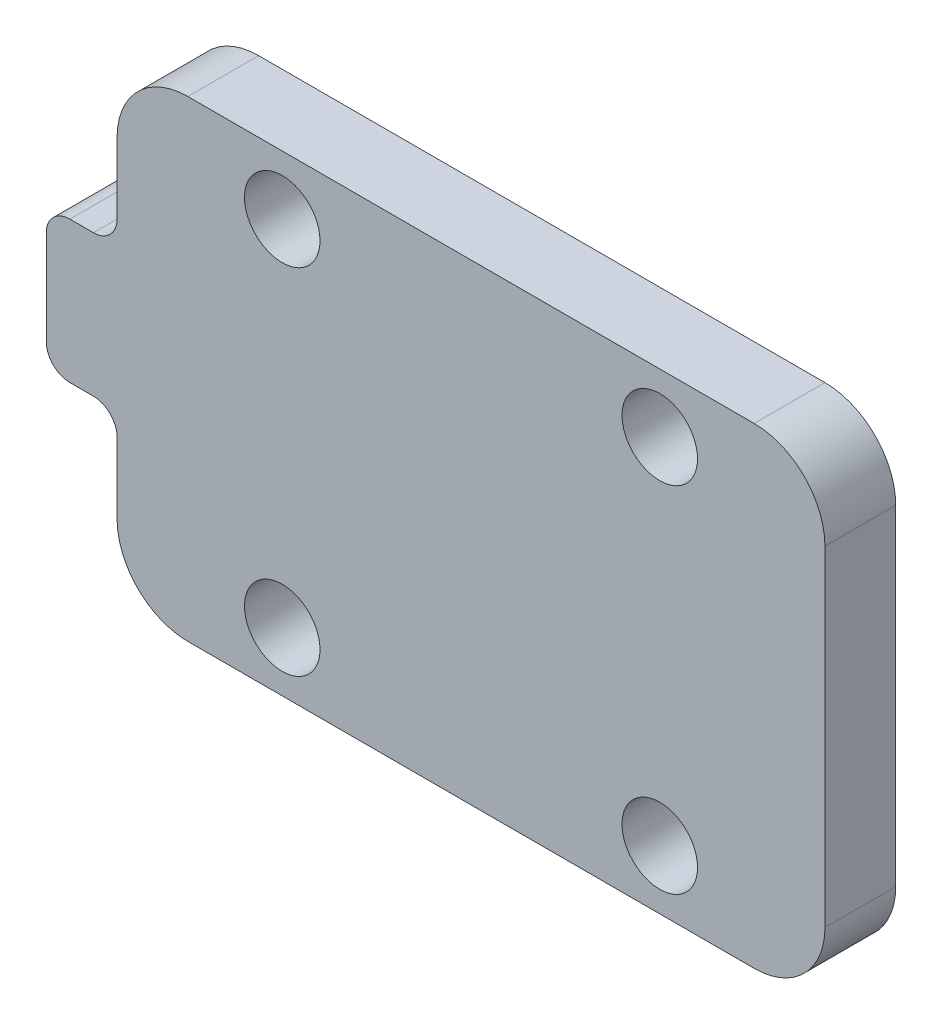
ISO-10303-21;
HEADER;
FILE_DESCRIPTION(('STEP AP214'),'2;1');
FILE_NAME('part.step','',(''),(''),'','','');
FILE_SCHEMA(('AUTOMOTIVE_DESIGN { 1 0 10303 214 1 1 1 1 }'));
ENDSEC;
DATA;
#1=APPLICATION_CONTEXT('core data for automotive mechanical design processes');
#2=APPLICATION_PROTOCOL_DEFINITION('international standard','automotive_design',2000,#1);
#3=PRODUCT_CONTEXT('',#1,'mechanical');
#4=PRODUCT('Part','Part','',(#3));
#5=PRODUCT_RELATED_PRODUCT_CATEGORY('part','',(#4));
#6=PRODUCT_DEFINITION_FORMATION('','',#4);
#7=PRODUCT_DEFINITION_CONTEXT('part definition',#1,'design');
#8=PRODUCT_DEFINITION('design','',#6,#7);
#9=PRODUCT_DEFINITION_SHAPE('','',#8);
#10=(LENGTH_UNIT() NAMED_UNIT(*) SI_UNIT(.MILLI.,.METRE.));
#11=(NAMED_UNIT(*) PLANE_ANGLE_UNIT() SI_UNIT($,.RADIAN.));
#12=(NAMED_UNIT(*) SI_UNIT($,.STERADIAN.) SOLID_ANGLE_UNIT());
#13=UNCERTAINTY_MEASURE_WITH_UNIT(LENGTH_MEASURE(1.E-05),#10,'distance_accuracy_value','');
#14=(GEOMETRIC_REPRESENTATION_CONTEXT(3) GLOBAL_UNCERTAINTY_ASSIGNED_CONTEXT((#13)) GLOBAL_UNIT_ASSIGNED_CONTEXT((#10,
#11,#12)) REPRESENTATION_CONTEXT('',''));
#15=CARTESIAN_POINT('',(0.,0.,0.));
#16=DIRECTION('',(0.,0.,1.));
#17=DIRECTION('',(1.,0.,0.));
#18=AXIS2_PLACEMENT_3D('',#15,#16,#17);
#19=CARTESIAN_POINT('',(0.,-20.,3.));
#20=DIRECTION('',(1.,0.,0.));
#21=DIRECTION('',(0.,0.,-1.));
#22=AXIS2_PLACEMENT_3D('',#19,#20,#21);
#23=PLANE('',#22);
#24=DIRECTION('',(0.,-1.,0.));
#25=VECTOR('',#24,1.);
#26=CARTESIAN_POINT('',(0.,-20.,0.));
#27=LINE('',#26,#25);
#28=CARTESIAN_POINT('',(0.,-3.,0.));
#29=VERTEX_POINT('',#28);
#30=CARTESIAN_POINT('',(0.,-6.,0.));
#31=VERTEX_POINT('',#30);
#32=EDGE_CURVE('E161',#29,#31,#27,.T.);
#33=ORIENTED_EDGE('',*,*,#32,.T.);
#34=DIRECTION('',(0.,0.,-1.));
#35=VECTOR('',#34,1.);
#36=CARTESIAN_POINT('',(0.,-6.,3.));
#37=LINE('',#36,#35);
#38=CARTESIAN_POINT('',(0.,-6.,3.));
#39=VERTEX_POINT('',#38);
#40=EDGE_CURVE('E221',#31,#39,#37,.F.);
#41=ORIENTED_EDGE('',*,*,#40,.T.);
#42=DIRECTION('',(0.,-1.,0.));
#43=VECTOR('',#42,1.);
#44=CARTESIAN_POINT('',(0.,-20.,3.));
#45=LINE('',#44,#43);
#46=CARTESIAN_POINT('',(0.,-3.,3.));
#47=VERTEX_POINT('',#46);
#48=EDGE_CURVE('E164',#47,#39,#45,.T.);
#49=ORIENTED_EDGE('',*,*,#48,.F.);
#50=DIRECTION('',(0.,0.,-1.));
#51=VECTOR('',#50,1.);
#52=CARTESIAN_POINT('',(0.,-3.,3.));
#53=LINE('',#52,#51);
#54=EDGE_CURVE('E149',#47,#29,#53,.T.);
#55=ORIENTED_EDGE('',*,*,#54,.T.);
#56=EDGE_LOOP('',(#33,#41,#49,#55));
#57=FACE_BOUND('',#56,.T.);
#58=ADVANCED_FACE('F33',(#57),#23,.F.);
#59=CARTESIAN_POINT('',(0.,-14.,3.));
#60=VERTEX_POINT('',#59);
#61=CARTESIAN_POINT('',(0.,-17.,3.));
#62=VERTEX_POINT('',#61);
#63=EDGE_CURVE('E187',#60,#62,#45,.T.);
#64=ORIENTED_EDGE('',*,*,#63,.F.);
#65=DIRECTION('',(0.,0.,-1.));
#66=VECTOR('',#65,1.);
#67=CARTESIAN_POINT('',(0.,-14.,3.));
#68=LINE('',#67,#66);
#69=CARTESIAN_POINT('',(0.,-14.,0.));
#70=VERTEX_POINT('',#69);
#71=EDGE_CURVE('E240',#60,#70,#68,.T.);
#72=ORIENTED_EDGE('',*,*,#71,.T.);
#73=CARTESIAN_POINT('',(0.,-17.,0.));
#74=VERTEX_POINT('',#73);
#75=EDGE_CURVE('E173',#70,#74,#27,.T.);
#76=ORIENTED_EDGE('',*,*,#75,.T.);
#77=DIRECTION('',(0.,0.,-1.));
#78=VECTOR('',#77,1.);
#79=CARTESIAN_POINT('',(0.,-17.,3.));
#80=LINE('',#79,#78);
#81=EDGE_CURVE('E166',#74,#62,#80,.F.);
#82=ORIENTED_EDGE('',*,*,#81,.T.);
#83=EDGE_LOOP('',(#64,#72,#76,#82));
#84=FACE_BOUND('',#83,.T.);
#85=ADVANCED_FACE('F258',(#84),#23,.F.);
#86=CARTESIAN_POINT('',(30.,-20.,3.));
#87=DIRECTION('',(0.,1.,0.));
#88=DIRECTION('',(0.,0.,1.));
#89=AXIS2_PLACEMENT_3D('',#86,#87,#88);
#90=PLANE('',#89);
#91=DIRECTION('',(1.,0.,0.));
#92=VECTOR('',#91,1.);
#93=CARTESIAN_POINT('',(30.,-20.,3.));
#94=LINE('',#93,#92);
#95=CARTESIAN_POINT('',(3.,-20.,3.));
#96=VERTEX_POINT('',#95);
#97=CARTESIAN_POINT('',(27.,-20.,3.));
#98=VERTEX_POINT('',#97);
#99=EDGE_CURVE('E262',#96,#98,#94,.T.);
#100=ORIENTED_EDGE('',*,*,#99,.F.);
#101=DIRECTION('',(0.,0.,-1.));
#102=VECTOR('',#101,1.);
#103=CARTESIAN_POINT('',(3.,-20.,3.));
#104=LINE('',#103,#102);
#105=CARTESIAN_POINT('',(3.,-20.,0.));
#106=VERTEX_POINT('',#105);
#107=EDGE_CURVE('E208',#96,#106,#104,.T.);
#108=ORIENTED_EDGE('',*,*,#107,.T.);
#109=DIRECTION('',(1.,0.,0.));
#110=VECTOR('',#109,1.);
#111=CARTESIAN_POINT('',(30.,-20.,0.));
#112=LINE('',#111,#110);
#113=CARTESIAN_POINT('',(27.,-20.,0.));
#114=VERTEX_POINT('',#113);
#115=EDGE_CURVE('E172',#106,#114,#112,.T.);
#116=ORIENTED_EDGE('',*,*,#115,.T.);
#117=DIRECTION('',(0.,0.,-1.));
#118=VECTOR('',#117,1.);
#119=CARTESIAN_POINT('',(27.,-20.,3.));
#120=LINE('',#119,#118);
#121=EDGE_CURVE('E206',#114,#98,#120,.F.);
#122=ORIENTED_EDGE('',*,*,#121,.T.);
#123=EDGE_LOOP('',(#100,#108,#116,#122));
#124=FACE_BOUND('',#123,.T.);
#125=ADVANCED_FACE('F293',(#124),#90,.F.);
#126=CARTESIAN_POINT('',(30.,0.,3.));
#127=DIRECTION('',(-1.,0.,0.));
#128=DIRECTION('',(0.,0.,1.));
#129=AXIS2_PLACEMENT_3D('',#126,#127,#128);
#130=PLANE('',#129);
#131=DIRECTION('',(0.,1.,0.));
#132=VECTOR('',#131,1.);
#133=CARTESIAN_POINT('',(30.,0.,3.));
#134=LINE('',#133,#132);
#135=CARTESIAN_POINT('',(30.,-17.,3.));
#136=VERTEX_POINT('',#135);
#137=CARTESIAN_POINT('',(30.,-3.,3.));
#138=VERTEX_POINT('',#137);
#139=EDGE_CURVE('E268',#136,#138,#134,.T.);
#140=ORIENTED_EDGE('',*,*,#139,.F.);
#141=DIRECTION('',(0.,0.,-1.));
#142=VECTOR('',#141,1.);
#143=CARTESIAN_POINT('',(30.,-17.,3.));
#144=LINE('',#143,#142);
#145=CARTESIAN_POINT('',(30.,-17.,0.));
#146=VERTEX_POINT('',#145);
#147=EDGE_CURVE('E213',#136,#146,#144,.T.);
#148=ORIENTED_EDGE('',*,*,#147,.T.);
#149=DIRECTION('',(0.,1.,0.));
#150=VECTOR('',#149,1.);
#151=CARTESIAN_POINT('',(30.,0.,0.));
#152=LINE('',#151,#150);
#153=CARTESIAN_POINT('',(30.,-3.,0.));
#154=VERTEX_POINT('',#153);
#155=EDGE_CURVE('E176',#146,#154,#152,.T.);
#156=ORIENTED_EDGE('',*,*,#155,.T.);
#157=DIRECTION('',(0.,0.,-1.));
#158=VECTOR('',#157,1.);
#159=CARTESIAN_POINT('',(30.,-3.,3.));
#160=LINE('',#159,#158);
#161=EDGE_CURVE('E211',#154,#138,#160,.F.);
#162=ORIENTED_EDGE('',*,*,#161,.T.);
#163=EDGE_LOOP('',(#140,#148,#156,#162));
#164=FACE_BOUND('',#163,.T.);
#165=ADVANCED_FACE('F284',(#164),#130,.F.);
#166=CARTESIAN_POINT('',(0.,0.,3.));
#167=DIRECTION('',(0.,-1.,0.));
#168=DIRECTION('',(0.,0.,-1.));
#169=AXIS2_PLACEMENT_3D('',#166,#167,#168);
#170=PLANE('',#169);
#171=DIRECTION('',(-1.,0.,0.));
#172=VECTOR('',#171,1.);
#173=CARTESIAN_POINT('',(0.,0.,0.));
#174=LINE('',#173,#172);
#175=CARTESIAN_POINT('',(27.,0.,0.));
#176=VERTEX_POINT('',#175);
#177=CARTESIAN_POINT('',(3.,0.,0.));
#178=VERTEX_POINT('',#177);
#179=EDGE_CURVE('E185',#176,#178,#174,.T.);
#180=ORIENTED_EDGE('',*,*,#179,.T.);
#181=DIRECTION('',(0.,0.,-1.));
#182=VECTOR('',#181,1.);
#183=CARTESIAN_POINT('',(3.,0.,3.));
#184=LINE('',#183,#182);
#185=CARTESIAN_POINT('',(3.,0.,3.));
#186=VERTEX_POINT('',#185);
#187=EDGE_CURVE('E150',#178,#186,#184,.F.);
#188=ORIENTED_EDGE('',*,*,#187,.T.);
#189=DIRECTION('',(-1.,0.,0.));
#190=VECTOR('',#189,1.);
#191=CARTESIAN_POINT('',(0.,0.,3.));
#192=LINE('',#191,#190);
#193=CARTESIAN_POINT('',(27.,0.,3.));
#194=VERTEX_POINT('',#193);
#195=EDGE_CURVE('E180',#194,#186,#192,.T.);
#196=ORIENTED_EDGE('',*,*,#195,.F.);
#197=DIRECTION('',(0.,0.,-1.));
#198=VECTOR('',#197,1.);
#199=CARTESIAN_POINT('',(27.,0.,3.));
#200=LINE('',#199,#198);
#201=EDGE_CURVE('E155',#194,#176,#200,.T.);
#202=ORIENTED_EDGE('',*,*,#201,.T.);
#203=EDGE_LOOP('',(#180,#188,#196,#202));
#204=FACE_BOUND('',#203,.T.);
#205=ADVANCED_FACE('F278',(#204),#170,.F.);
#206=CARTESIAN_POINT('',(0.,0.,3.));
#207=DIRECTION('',(0.,0.,-1.));
#208=DIRECTION('',(-1.,0.,0.));
#209=AXIS2_PLACEMENT_3D('',#206,#207,#208);
#210=PLANE('',#209);
#211=CARTESIAN_POINT('',(7.00000000000012,-2.49999999999979,3.));
#212=DIRECTION('',(0.,0.,1.));
#213=DIRECTION('',(1.,0.,0.));
#214=AXIS2_PLACEMENT_3D('',#211,#212,#213);
#215=CIRCLE('',#214,1.6);
#216=CARTESIAN_POINT('',(8.60000000000012,-2.49999999999979,3.));
#217=VERTEX_POINT('',#216);
#218=EDGE_CURVE('E358',#217,#217,#215,.T.);
#219=ORIENTED_EDGE('',*,*,#218,.F.);
#220=EDGE_LOOP('',(#219));
#221=FACE_BOUND('',#220,.T.);
#222=CARTESIAN_POINT('',(7.00000000000011,-17.4999999999998,3.));
#223=DIRECTION('',(0.,0.,1.));
#224=DIRECTION('',(1.,0.,0.));
#225=AXIS2_PLACEMENT_3D('',#222,#223,#224);
#226=CIRCLE('',#225,1.6);
#227=CARTESIAN_POINT('',(8.60000000000012,-17.4999999999998,3.));
#228=VERTEX_POINT('',#227);
#229=EDGE_CURVE('E396',#228,#228,#226,.T.);
#230=ORIENTED_EDGE('',*,*,#229,.F.);
#231=EDGE_LOOP('',(#230));
#232=FACE_BOUND('',#231,.T.);
#233=CARTESIAN_POINT('',(23.0000000000001,-17.4999999999998,3.));
#234=DIRECTION('',(0.,0.,1.));
#235=DIRECTION('',(1.,0.,0.));
#236=AXIS2_PLACEMENT_3D('',#233,#234,#235);
#237=CIRCLE('',#236,1.6);
#238=CARTESIAN_POINT('',(24.6000000000001,-17.4999999999998,3.));
#239=VERTEX_POINT('',#238);
#240=EDGE_CURVE('E390',#239,#239,#237,.T.);
#241=ORIENTED_EDGE('',*,*,#240,.F.);
#242=EDGE_LOOP('',(#241));
#243=FACE_BOUND('',#242,.T.);
#244=CARTESIAN_POINT('',(23.0000000000001,-2.49999999999979,3.));
#245=DIRECTION('',(0.,0.,1.));
#246=DIRECTION('',(1.,0.,0.));
#247=AXIS2_PLACEMENT_3D('',#244,#245,#246);
#248=CIRCLE('',#247,1.6);
#249=CARTESIAN_POINT('',(24.6000000000001,-2.49999999999979,3.));
#250=VERTEX_POINT('',#249);
#251=EDGE_CURVE('E265',#250,#250,#248,.T.);
#252=ORIENTED_EDGE('',*,*,#251,.F.);
#253=EDGE_LOOP('',(#252));
#254=FACE_BOUND('',#253,.T.);
#255=DIRECTION('',(1.,0.,0.));
#256=VECTOR('',#255,1.);
#257=CARTESIAN_POINT('',(0.,-7.,3.));
#258=LINE('',#257,#256);
#259=CARTESIAN_POINT('',(-2.,-7.,3.));
#260=VERTEX_POINT('',#259);
#261=CARTESIAN_POINT('',(-1.,-7.,3.));
#262=VERTEX_POINT('',#261);
#263=EDGE_CURVE('E353',#260,#262,#258,.T.);
#264=ORIENTED_EDGE('',*,*,#263,.F.);
#265=CARTESIAN_POINT('',(-2.,-8.,3.));
#266=DIRECTION('',(0.,0.,-1.));
#267=DIRECTION('',(-1.,0.,0.));
#268=AXIS2_PLACEMENT_3D('',#265,#266,#267);
#269=CIRCLE('',#268,1.);
#270=CARTESIAN_POINT('',(-3.,-8.,3.));
#271=VERTEX_POINT('',#270);
#272=EDGE_CURVE('E233',#260,#271,#269,.F.);
#273=ORIENTED_EDGE('',*,*,#272,.T.);
#274=DIRECTION('',(0.,1.,0.));
#275=VECTOR('',#274,1.);
#276=CARTESIAN_POINT('',(-3.,-7.,3.));
#277=LINE('',#276,#275);
#278=CARTESIAN_POINT('',(-3.,-12.,3.));
#279=VERTEX_POINT('',#278);
#280=EDGE_CURVE('E359',#279,#271,#277,.T.);
#281=ORIENTED_EDGE('',*,*,#280,.F.);
#282=CARTESIAN_POINT('',(-2.,-12.,3.));
#283=DIRECTION('',(0.,0.,-1.));
#284=DIRECTION('',(-1.,0.,0.));
#285=AXIS2_PLACEMENT_3D('',#282,#283,#284);
#286=CIRCLE('',#285,1.);
#287=CARTESIAN_POINT('',(-2.,-13.,3.));
#288=VERTEX_POINT('',#287);
#289=EDGE_CURVE('E52',#279,#288,#286,.F.);
#290=ORIENTED_EDGE('',*,*,#289,.T.);
#291=DIRECTION('',(-1.,0.,0.));
#292=VECTOR('',#291,1.);
#293=CARTESIAN_POINT('',(-3.,-13.,3.));
#294=LINE('',#293,#292);
#295=CARTESIAN_POINT('',(-1.,-13.,3.));
#296=VERTEX_POINT('',#295);
#297=EDGE_CURVE('E384',#296,#288,#294,.T.);
#298=ORIENTED_EDGE('',*,*,#297,.F.);
#299=CARTESIAN_POINT('',(-1.,-14.,3.));
#300=DIRECTION('',(0.,0.,-1.));
#301=DIRECTION('',(-1.,0.,0.));
#302=AXIS2_PLACEMENT_3D('',#299,#300,#301);
#303=CIRCLE('',#302,1.);
#304=EDGE_CURVE('E11',#296,#60,#303,.T.);
#305=ORIENTED_EDGE('',*,*,#304,.T.);
#306=ORIENTED_EDGE('',*,*,#63,.T.);
#307=CARTESIAN_POINT('',(3.,-17.,3.));
#308=DIRECTION('',(0.,0.,-1.));
#309=DIRECTION('',(-1.,0.,0.));
#310=AXIS2_PLACEMENT_3D('',#307,#308,#309);
#311=CIRCLE('',#310,3.);
#312=EDGE_CURVE('E202',#62,#96,#311,.F.);
#313=ORIENTED_EDGE('',*,*,#312,.T.);
#314=ORIENTED_EDGE('',*,*,#99,.T.);
#315=CARTESIAN_POINT('',(27.,-17.,3.));
#316=DIRECTION('',(0.,0.,-1.));
#317=DIRECTION('',(-1.,0.,0.));
#318=AXIS2_PLACEMENT_3D('',#315,#316,#317);
#319=CIRCLE('',#318,3.);
#320=EDGE_CURVE('E200',#98,#136,#319,.F.);
#321=ORIENTED_EDGE('',*,*,#320,.T.);
#322=ORIENTED_EDGE('',*,*,#139,.T.);
#323=CARTESIAN_POINT('',(27.,-3.,3.));
#324=DIRECTION('',(0.,0.,-1.));
#325=DIRECTION('',(-1.,0.,0.));
#326=AXIS2_PLACEMENT_3D('',#323,#324,#325);
#327=CIRCLE('',#326,3.);
#328=EDGE_CURVE('E198',#138,#194,#327,.F.);
#329=ORIENTED_EDGE('',*,*,#328,.T.);
#330=ORIENTED_EDGE('',*,*,#195,.T.);
#331=CARTESIAN_POINT('',(3.,-3.,3.));
#332=DIRECTION('',(0.,0.,-1.));
#333=DIRECTION('',(-1.,0.,0.));
#334=AXIS2_PLACEMENT_3D('',#331,#332,#333);
#335=CIRCLE('',#334,3.);
#336=EDGE_CURVE('E204',#186,#47,#335,.F.);
#337=ORIENTED_EDGE('',*,*,#336,.T.);
#338=ORIENTED_EDGE('',*,*,#48,.T.);
#339=CARTESIAN_POINT('',(-1.,-6.,3.));
#340=DIRECTION('',(0.,0.,-1.));
#341=DIRECTION('',(-1.,0.,0.));
#342=AXIS2_PLACEMENT_3D('',#339,#340,#341);
#343=CIRCLE('',#342,1.);
#344=EDGE_CURVE('E244',#39,#262,#343,.T.);
#345=ORIENTED_EDGE('',*,*,#344,.T.);
#346=EDGE_LOOP('',(#264,#273,#281,#290,#298,#305,#306,#313,#314,#321,#322,#329,#330,#337,#338,#345));
#347=FACE_BOUND('',#346,.T.);
#348=ADVANCED_FACE('F275',(#221,#232,#243,#254,#347),#210,.F.);
#349=CARTESIAN_POINT('',(0.,0.,0.));
#350=DIRECTION('',(0.,0.,-1.));
#351=DIRECTION('',(-1.,0.,0.));
#352=AXIS2_PLACEMENT_3D('',#349,#350,#351);
#353=PLANE('',#352);
#354=CARTESIAN_POINT('',(7.00000000000012,-2.49999999999979,0.));
#355=DIRECTION('',(0.,0.,1.));
#356=DIRECTION('',(1.,0.,0.));
#357=AXIS2_PLACEMENT_3D('',#354,#355,#356);
#358=CIRCLE('',#357,1.6);
#359=CARTESIAN_POINT('',(8.60000000000012,-2.49999999999979,0.));
#360=VERTEX_POINT('',#359);
#361=EDGE_CURVE('E399',#360,#360,#358,.T.);
#362=ORIENTED_EDGE('',*,*,#361,.T.);
#363=EDGE_LOOP('',(#362));
#364=FACE_BOUND('',#363,.T.);
#365=CARTESIAN_POINT('',(7.00000000000011,-17.4999999999998,0.));
#366=DIRECTION('',(0.,0.,1.));
#367=DIRECTION('',(1.,0.,0.));
#368=AXIS2_PLACEMENT_3D('',#365,#366,#367);
#369=CIRCLE('',#368,1.6);
#370=CARTESIAN_POINT('',(8.60000000000012,-17.4999999999998,0.));
#371=VERTEX_POINT('',#370);
#372=EDGE_CURVE('E393',#371,#371,#369,.T.);
#373=ORIENTED_EDGE('',*,*,#372,.T.);
#374=EDGE_LOOP('',(#373));
#375=FACE_BOUND('',#374,.T.);
#376=CARTESIAN_POINT('',(23.0000000000001,-17.4999999999998,0.));
#377=DIRECTION('',(0.,0.,1.));
#378=DIRECTION('',(1.,0.,0.));
#379=AXIS2_PLACEMENT_3D('',#376,#377,#378);
#380=CIRCLE('',#379,1.6);
#381=CARTESIAN_POINT('',(24.6000000000001,-17.4999999999998,0.));
#382=VERTEX_POINT('',#381);
#383=EDGE_CURVE('E387',#382,#382,#380,.T.);
#384=ORIENTED_EDGE('',*,*,#383,.T.);
#385=EDGE_LOOP('',(#384));
#386=FACE_BOUND('',#385,.T.);
#387=CARTESIAN_POINT('',(23.0000000000001,-2.49999999999979,0.));
#388=DIRECTION('',(0.,0.,1.));
#389=DIRECTION('',(1.,0.,0.));
#390=AXIS2_PLACEMENT_3D('',#387,#388,#389);
#391=CIRCLE('',#390,1.6);
#392=CARTESIAN_POINT('',(24.6000000000001,-2.49999999999979,0.));
#393=VERTEX_POINT('',#392);
#394=EDGE_CURVE('E178',#393,#393,#391,.T.);
#395=ORIENTED_EDGE('',*,*,#394,.T.);
#396=EDGE_LOOP('',(#395));
#397=FACE_BOUND('',#396,.T.);
#398=DIRECTION('',(0.,1.,0.));
#399=VECTOR('',#398,1.);
#400=CARTESIAN_POINT('',(-3.,-7.,0.));
#401=LINE('',#400,#399);
#402=CARTESIAN_POINT('',(-3.,-12.,0.));
#403=VERTEX_POINT('',#402);
#404=CARTESIAN_POINT('',(-3.,-8.,0.));
#405=VERTEX_POINT('',#404);
#406=EDGE_CURVE('E255',#403,#405,#401,.T.);
#407=ORIENTED_EDGE('',*,*,#406,.T.);
#408=CARTESIAN_POINT('',(-2.,-8.,0.));
#409=DIRECTION('',(0.,0.,-1.));
#410=DIRECTION('',(-1.,0.,0.));
#411=AXIS2_PLACEMENT_3D('',#408,#409,#410);
#412=CIRCLE('',#411,1.);
#413=CARTESIAN_POINT('',(-2.,-7.,0.));
#414=VERTEX_POINT('',#413);
#415=EDGE_CURVE('E230',#405,#414,#412,.T.);
#416=ORIENTED_EDGE('',*,*,#415,.T.);
#417=DIRECTION('',(1.,0.,0.));
#418=VECTOR('',#417,1.);
#419=CARTESIAN_POINT('',(0.,-7.,0.));
#420=LINE('',#419,#418);
#421=CARTESIAN_POINT('',(-1.,-7.,0.));
#422=VERTEX_POINT('',#421);
#423=EDGE_CURVE('E382',#414,#422,#420,.T.);
#424=ORIENTED_EDGE('',*,*,#423,.T.);
#425=CARTESIAN_POINT('',(-1.,-6.,0.));
#426=DIRECTION('',(0.,0.,-1.));
#427=DIRECTION('',(-1.,0.,0.));
#428=AXIS2_PLACEMENT_3D('',#425,#426,#427);
#429=CIRCLE('',#428,1.);
#430=EDGE_CURVE('E171',#422,#31,#429,.F.);
#431=ORIENTED_EDGE('',*,*,#430,.T.);
#432=ORIENTED_EDGE('',*,*,#32,.F.);
#433=CARTESIAN_POINT('',(3.,-3.,0.));
#434=DIRECTION('',(0.,0.,-1.));
#435=DIRECTION('',(-1.,0.,0.));
#436=AXIS2_PLACEMENT_3D('',#433,#434,#435);
#437=CIRCLE('',#436,3.);
#438=EDGE_CURVE('E145',#29,#178,#437,.T.);
#439=ORIENTED_EDGE('',*,*,#438,.T.);
#440=ORIENTED_EDGE('',*,*,#179,.F.);
#441=CARTESIAN_POINT('',(27.,-3.,0.));
#442=DIRECTION('',(0.,0.,-1.));
#443=DIRECTION('',(-1.,0.,0.));
#444=AXIS2_PLACEMENT_3D('',#441,#442,#443);
#445=CIRCLE('',#444,3.);
#446=EDGE_CURVE('E165',#176,#154,#445,.T.);
#447=ORIENTED_EDGE('',*,*,#446,.T.);
#448=ORIENTED_EDGE('',*,*,#155,.F.);
#449=CARTESIAN_POINT('',(27.,-17.,0.));
#450=DIRECTION('',(0.,0.,-1.));
#451=DIRECTION('',(-1.,0.,0.));
#452=AXIS2_PLACEMENT_3D('',#449,#450,#451);
#453=CIRCLE('',#452,3.);
#454=EDGE_CURVE('E191',#146,#114,#453,.T.);
#455=ORIENTED_EDGE('',*,*,#454,.T.);
#456=ORIENTED_EDGE('',*,*,#115,.F.);
#457=CARTESIAN_POINT('',(3.,-17.,0.));
#458=DIRECTION('',(0.,0.,-1.));
#459=DIRECTION('',(-1.,0.,0.));
#460=AXIS2_PLACEMENT_3D('',#457,#458,#459);
#461=CIRCLE('',#460,3.);
#462=EDGE_CURVE('E156',#106,#74,#461,.T.);
#463=ORIENTED_EDGE('',*,*,#462,.T.);
#464=ORIENTED_EDGE('',*,*,#75,.F.);
#465=CARTESIAN_POINT('',(-1.,-14.,0.));
#466=DIRECTION('',(0.,0.,-1.));
#467=DIRECTION('',(-1.,0.,0.));
#468=AXIS2_PLACEMENT_3D('',#465,#466,#467);
#469=CIRCLE('',#468,1.);
#470=CARTESIAN_POINT('',(-1.,-13.,0.));
#471=VERTEX_POINT('',#470);
#472=EDGE_CURVE('E41',#70,#471,#469,.F.);
#473=ORIENTED_EDGE('',*,*,#472,.T.);
#474=DIRECTION('',(-1.,0.,0.));
#475=VECTOR('',#474,1.);
#476=CARTESIAN_POINT('',(-3.,-13.,0.));
#477=LINE('',#476,#475);
#478=CARTESIAN_POINT('',(-2.,-13.,0.));
#479=VERTEX_POINT('',#478);
#480=EDGE_CURVE('E248',#471,#479,#477,.T.);
#481=ORIENTED_EDGE('',*,*,#480,.T.);
#482=CARTESIAN_POINT('',(-2.,-12.,0.));
#483=DIRECTION('',(0.,0.,-1.));
#484=DIRECTION('',(-1.,0.,0.));
#485=AXIS2_PLACEMENT_3D('',#482,#483,#484);
#486=CIRCLE('',#485,1.);
#487=EDGE_CURVE('E228',#479,#403,#486,.T.);
#488=ORIENTED_EDGE('',*,*,#487,.T.);
#489=EDGE_LOOP('',(#407,#416,#424,#431,#432,#439,#440,#447,#448,#455,#456,#463,#464,#473,#481,#488));
#490=FACE_BOUND('',#489,.T.);
#491=ADVANCED_FACE('F169',(#364,#375,#386,#397,#490),#353,.T.);
#492=CARTESIAN_POINT('',(3.,-3.,3.));
#493=DIRECTION('',(0.,0.,-1.));
#494=DIRECTION('',(-1.,0.,0.));
#495=AXIS2_PLACEMENT_3D('',#492,#493,#494);
#496=CYLINDRICAL_SURFACE('',#495,3.);
#497=ORIENTED_EDGE('',*,*,#336,.F.);
#498=ORIENTED_EDGE('',*,*,#187,.F.);
#499=ORIENTED_EDGE('',*,*,#438,.F.);
#500=ORIENTED_EDGE('',*,*,#54,.F.);
#501=EDGE_LOOP('',(#497,#498,#499,#500));
#502=FACE_BOUND('',#501,.T.);
#503=ADVANCED_FACE('F148',(#502),#496,.T.);
#504=CARTESIAN_POINT('',(3.,-17.,3.));
#505=DIRECTION('',(0.,0.,-1.));
#506=DIRECTION('',(-1.,0.,0.));
#507=AXIS2_PLACEMENT_3D('',#504,#505,#506);
#508=CYLINDRICAL_SURFACE('',#507,3.);
#509=ORIENTED_EDGE('',*,*,#312,.F.);
#510=ORIENTED_EDGE('',*,*,#81,.F.);
#511=ORIENTED_EDGE('',*,*,#462,.F.);
#512=ORIENTED_EDGE('',*,*,#107,.F.);
#513=EDGE_LOOP('',(#509,#510,#511,#512));
#514=FACE_BOUND('',#513,.T.);
#515=ADVANCED_FACE('F296',(#514),#508,.T.);
#516=CARTESIAN_POINT('',(27.,-17.,3.));
#517=DIRECTION('',(0.,0.,-1.));
#518=DIRECTION('',(-1.,0.,0.));
#519=AXIS2_PLACEMENT_3D('',#516,#517,#518);
#520=CYLINDRICAL_SURFACE('',#519,3.);
#521=ORIENTED_EDGE('',*,*,#320,.F.);
#522=ORIENTED_EDGE('',*,*,#121,.F.);
#523=ORIENTED_EDGE('',*,*,#454,.F.);
#524=ORIENTED_EDGE('',*,*,#147,.F.);
#525=EDGE_LOOP('',(#521,#522,#523,#524));
#526=FACE_BOUND('',#525,.T.);
#527=ADVANCED_FACE('F288',(#526),#520,.T.);
#528=CARTESIAN_POINT('',(27.,-3.,3.));
#529=DIRECTION('',(0.,0.,-1.));
#530=DIRECTION('',(-1.,0.,0.));
#531=AXIS2_PLACEMENT_3D('',#528,#529,#530);
#532=CYLINDRICAL_SURFACE('',#531,3.);
#533=ORIENTED_EDGE('',*,*,#328,.F.);
#534=ORIENTED_EDGE('',*,*,#161,.F.);
#535=ORIENTED_EDGE('',*,*,#446,.F.);
#536=ORIENTED_EDGE('',*,*,#201,.F.);
#537=EDGE_LOOP('',(#533,#534,#535,#536));
#538=FACE_BOUND('',#537,.T.);
#539=ADVANCED_FACE('F280',(#538),#532,.T.);
#540=CARTESIAN_POINT('',(23.0000000000001,-2.49999999999979,0.));
#541=DIRECTION('',(0.,0.,1.));
#542=DIRECTION('',(1.,0.,0.));
#543=AXIS2_PLACEMENT_3D('',#540,#541,#542);
#544=CYLINDRICAL_SURFACE('',#543,1.6);
#545=ORIENTED_EDGE('',*,*,#394,.F.);
#546=EDGE_LOOP('',(#545));
#547=FACE_BOUND('',#546,.T.);
#548=ORIENTED_EDGE('',*,*,#251,.T.);
#549=EDGE_LOOP('',(#548));
#550=FACE_BOUND('',#549,.T.);
#551=ADVANCED_FACE('F324',(#547,#550),#544,.F.);
#552=CARTESIAN_POINT('',(23.0000000000001,-17.4999999999998,0.));
#553=DIRECTION('',(0.,0.,1.));
#554=DIRECTION('',(1.,0.,0.));
#555=AXIS2_PLACEMENT_3D('',#552,#553,#554);
#556=CYLINDRICAL_SURFACE('',#555,1.6);
#557=ORIENTED_EDGE('',*,*,#383,.F.);
#558=EDGE_LOOP('',(#557));
#559=FACE_BOUND('',#558,.T.);
#560=ORIENTED_EDGE('',*,*,#240,.T.);
#561=EDGE_LOOP('',(#560));
#562=FACE_BOUND('',#561,.T.);
#563=ADVANCED_FACE('F327',(#559,#562),#556,.F.);
#564=CARTESIAN_POINT('',(7.00000000000011,-17.4999999999998,0.));
#565=DIRECTION('',(0.,0.,1.));
#566=DIRECTION('',(1.,0.,0.));
#567=AXIS2_PLACEMENT_3D('',#564,#565,#566);
#568=CYLINDRICAL_SURFACE('',#567,1.6);
#569=ORIENTED_EDGE('',*,*,#372,.F.);
#570=EDGE_LOOP('',(#569));
#571=FACE_BOUND('',#570,.T.);
#572=ORIENTED_EDGE('',*,*,#229,.T.);
#573=EDGE_LOOP('',(#572));
#574=FACE_BOUND('',#573,.T.);
#575=ADVANCED_FACE('F333',(#571,#574),#568,.F.);
#576=CARTESIAN_POINT('',(7.00000000000012,-2.49999999999979,0.));
#577=DIRECTION('',(0.,0.,1.));
#578=DIRECTION('',(1.,0.,0.));
#579=AXIS2_PLACEMENT_3D('',#576,#577,#578);
#580=CYLINDRICAL_SURFACE('',#579,1.6);
#581=ORIENTED_EDGE('',*,*,#361,.F.);
#582=EDGE_LOOP('',(#581));
#583=FACE_BOUND('',#582,.T.);
#584=ORIENTED_EDGE('',*,*,#218,.T.);
#585=EDGE_LOOP('',(#584));
#586=FACE_BOUND('',#585,.T.);
#587=ADVANCED_FACE('F329',(#583,#586),#580,.F.);
#588=CARTESIAN_POINT('',(0.,-7.,3.));
#589=DIRECTION('',(0.,1.,0.));
#590=DIRECTION('',(0.,0.,1.));
#591=AXIS2_PLACEMENT_3D('',#588,#589,#590);
#592=PLANE('',#591);
#593=ORIENTED_EDGE('',*,*,#263,.T.);
#594=DIRECTION('',(0.,0.,-1.));
#595=VECTOR('',#594,1.);
#596=CARTESIAN_POINT('',(-1.,-7.,3.));
#597=LINE('',#596,#595);
#598=EDGE_CURVE('E218',#262,#422,#597,.T.);
#599=ORIENTED_EDGE('',*,*,#598,.T.);
#600=ORIENTED_EDGE('',*,*,#423,.F.);
#601=DIRECTION('',(0.,0.,-1.));
#602=VECTOR('',#601,1.);
#603=CARTESIAN_POINT('',(-2.,-7.,3.));
#604=LINE('',#603,#602);
#605=EDGE_CURVE('E216',#414,#260,#604,.F.);
#606=ORIENTED_EDGE('',*,*,#605,.T.);
#607=EDGE_LOOP('',(#593,#599,#600,#606));
#608=FACE_BOUND('',#607,.T.);
#609=ADVANCED_FACE('F332',(#608),#592,.T.);
#610=CARTESIAN_POINT('',(-3.,-7.,3.));
#611=DIRECTION('',(-1.,0.,0.));
#612=DIRECTION('',(0.,0.,1.));
#613=AXIS2_PLACEMENT_3D('',#610,#611,#612);
#614=PLANE('',#613);
#615=ORIENTED_EDGE('',*,*,#280,.T.);
#616=DIRECTION('',(0.,0.,-1.));
#617=VECTOR('',#616,1.);
#618=CARTESIAN_POINT('',(-3.,-8.,3.));
#619=LINE('',#618,#617);
#620=EDGE_CURVE('E225',#271,#405,#619,.T.);
#621=ORIENTED_EDGE('',*,*,#620,.T.);
#622=ORIENTED_EDGE('',*,*,#406,.F.);
#623=DIRECTION('',(0.,0.,-1.));
#624=VECTOR('',#623,1.);
#625=CARTESIAN_POINT('',(-3.,-12.,3.));
#626=LINE('',#625,#624);
#627=EDGE_CURVE('E223',#403,#279,#626,.F.);
#628=ORIENTED_EDGE('',*,*,#627,.T.);
#629=EDGE_LOOP('',(#615,#621,#622,#628));
#630=FACE_BOUND('',#629,.T.);
#631=ADVANCED_FACE('F344',(#630),#614,.T.);
#632=CARTESIAN_POINT('',(-3.,-13.,3.));
#633=DIRECTION('',(0.,-1.,0.));
#634=DIRECTION('',(0.,0.,-1.));
#635=AXIS2_PLACEMENT_3D('',#632,#633,#634);
#636=PLANE('',#635);
#637=ORIENTED_EDGE('',*,*,#297,.T.);
#638=DIRECTION('',(0.,0.,-1.));
#639=VECTOR('',#638,1.);
#640=CARTESIAN_POINT('',(-2.,-13.,3.));
#641=LINE('',#640,#639);
#642=EDGE_CURVE('E237',#288,#479,#641,.T.);
#643=ORIENTED_EDGE('',*,*,#642,.T.);
#644=ORIENTED_EDGE('',*,*,#480,.F.);
#645=DIRECTION('',(0.,0.,-1.));
#646=VECTOR('',#645,1.);
#647=CARTESIAN_POINT('',(-1.,-13.,3.));
#648=LINE('',#647,#646);
#649=EDGE_CURVE('E235',#471,#296,#648,.F.);
#650=ORIENTED_EDGE('',*,*,#649,.T.);
#651=EDGE_LOOP('',(#637,#643,#644,#650));
#652=FACE_BOUND('',#651,.T.);
#653=ADVANCED_FACE('F253',(#652),#636,.T.);
#654=CARTESIAN_POINT('',(-1.,-6.,3.));
#655=DIRECTION('',(0.,0.,-1.));
#656=DIRECTION('',(-1.,0.,0.));
#657=AXIS2_PLACEMENT_3D('',#654,#655,#656);
#658=CYLINDRICAL_SURFACE('',#657,1.);
#659=ORIENTED_EDGE('',*,*,#344,.F.);
#660=ORIENTED_EDGE('',*,*,#40,.F.);
#661=ORIENTED_EDGE('',*,*,#430,.F.);
#662=ORIENTED_EDGE('',*,*,#598,.F.);
#663=EDGE_LOOP('',(#659,#660,#661,#662));
#664=FACE_BOUND('',#663,.T.);
#665=ADVANCED_FACE('F343',(#664),#658,.F.);
#666=CARTESIAN_POINT('',(-2.,-8.,3.));
#667=DIRECTION('',(0.,0.,-1.));
#668=DIRECTION('',(-1.,0.,0.));
#669=AXIS2_PLACEMENT_3D('',#666,#667,#668);
#670=CYLINDRICAL_SURFACE('',#669,1.);
#671=ORIENTED_EDGE('',*,*,#272,.F.);
#672=ORIENTED_EDGE('',*,*,#605,.F.);
#673=ORIENTED_EDGE('',*,*,#415,.F.);
#674=ORIENTED_EDGE('',*,*,#620,.F.);
#675=EDGE_LOOP('',(#671,#672,#673,#674));
#676=FACE_BOUND('',#675,.T.);
#677=ADVANCED_FACE('F364',(#676),#670,.T.);
#678=CARTESIAN_POINT('',(-2.,-12.,3.));
#679=DIRECTION('',(0.,0.,-1.));
#680=DIRECTION('',(-1.,0.,0.));
#681=AXIS2_PLACEMENT_3D('',#678,#679,#680);
#682=CYLINDRICAL_SURFACE('',#681,1.);
#683=ORIENTED_EDGE('',*,*,#289,.F.);
#684=ORIENTED_EDGE('',*,*,#627,.F.);
#685=ORIENTED_EDGE('',*,*,#487,.F.);
#686=ORIENTED_EDGE('',*,*,#642,.F.);
#687=EDGE_LOOP('',(#683,#684,#685,#686));
#688=FACE_BOUND('',#687,.T.);
#689=ADVANCED_FACE('F369',(#688),#682,.T.);
#690=CARTESIAN_POINT('',(-1.,-14.,3.));
#691=DIRECTION('',(0.,0.,-1.));
#692=DIRECTION('',(-1.,0.,0.));
#693=AXIS2_PLACEMENT_3D('',#690,#691,#692);
#694=CYLINDRICAL_SURFACE('',#693,1.);
#695=ORIENTED_EDGE('',*,*,#304,.F.);
#696=ORIENTED_EDGE('',*,*,#649,.F.);
#697=ORIENTED_EDGE('',*,*,#472,.F.);
#698=ORIENTED_EDGE('',*,*,#71,.F.);
#699=EDGE_LOOP('',(#695,#696,#697,#698));
#700=FACE_BOUND('',#699,.T.);
#701=ADVANCED_FACE('F35',(#700),#694,.F.);
#702=CLOSED_SHELL('',(#58,#85,#125,#165,#205,#348,#491,#503,#515,#527,#539,#551,#563,#575,#587,
#609,#631,#653,#665,#677,#689,#701));
#703=MANIFOLD_SOLID_BREP('B2',#702);
#704=ADVANCED_BREP_SHAPE_REPRESENTATION('',(#18,#703),#14);
#705=SHAPE_DEFINITION_REPRESENTATION(#9,#704);
ENDSEC;
END-ISO-10303-21;
